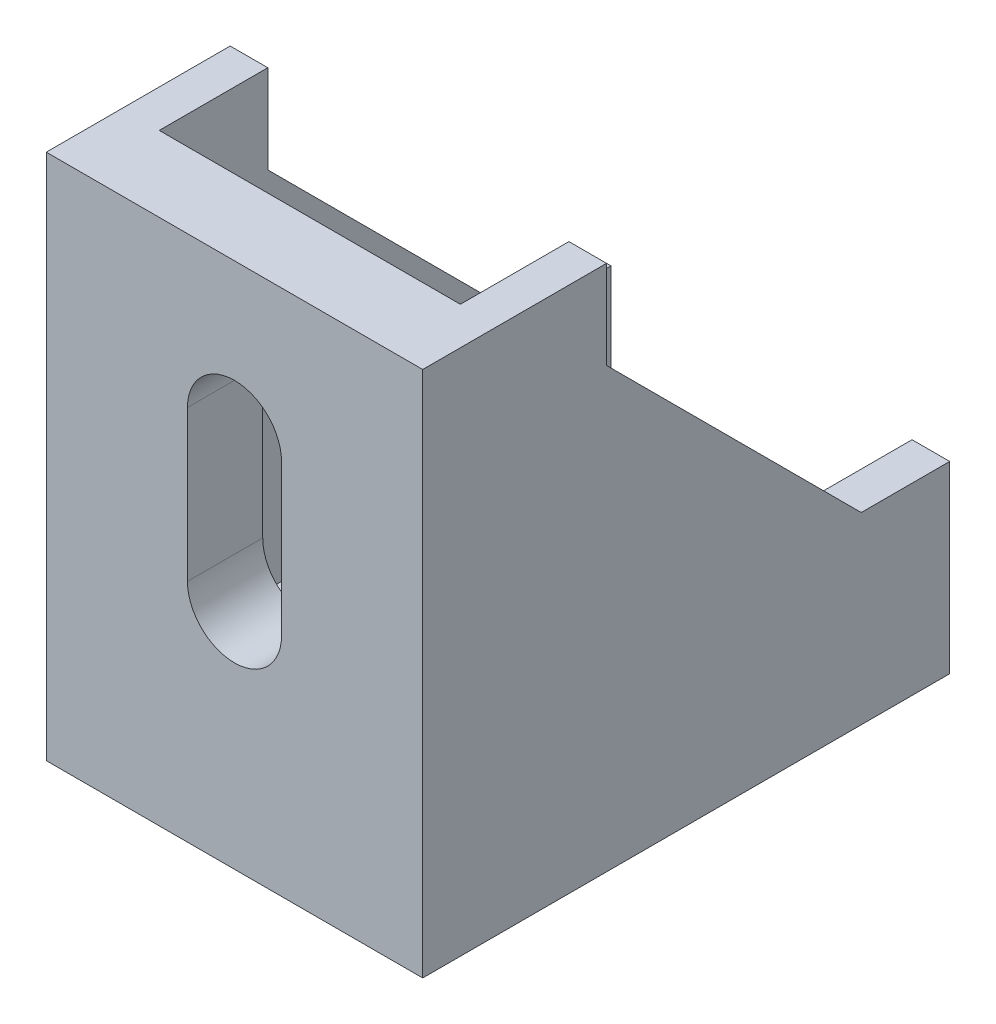
ISO-10303-21;
HEADER;
FILE_DESCRIPTION(('STEP AP214'),'2;1');
FILE_NAME('part.step','',(''),(''),'','','');
FILE_SCHEMA(('AUTOMOTIVE_DESIGN { 1 0 10303 214 1 1 1 1 }'));
ENDSEC;
DATA;
#1=APPLICATION_CONTEXT('core data for automotive mechanical design processes');
#2=APPLICATION_PROTOCOL_DEFINITION('international standard','automotive_design',2000,#1);
#3=PRODUCT_CONTEXT('',#1,'mechanical');
#4=PRODUCT('Part','Part','',(#3));
#5=PRODUCT_RELATED_PRODUCT_CATEGORY('part','',(#4));
#6=PRODUCT_DEFINITION_FORMATION('','',#4);
#7=PRODUCT_DEFINITION_CONTEXT('part definition',#1,'design');
#8=PRODUCT_DEFINITION('design','',#6,#7);
#9=PRODUCT_DEFINITION_SHAPE('','',#8);
#10=(LENGTH_UNIT() NAMED_UNIT(*) SI_UNIT(.MILLI.,.METRE.));
#11=(NAMED_UNIT(*) PLANE_ANGLE_UNIT() SI_UNIT($,.RADIAN.));
#12=(NAMED_UNIT(*) SI_UNIT($,.STERADIAN.) SOLID_ANGLE_UNIT());
#13=UNCERTAINTY_MEASURE_WITH_UNIT(LENGTH_MEASURE(1.E-05),#10,'distance_accuracy_value','');
#14=(GEOMETRIC_REPRESENTATION_CONTEXT(3) GLOBAL_UNCERTAINTY_ASSIGNED_CONTEXT((#13)) GLOBAL_UNIT_ASSIGNED_CONTEXT((#10,
#11,#12)) REPRESENTATION_CONTEXT('',''));
#15=CARTESIAN_POINT('',(0.,0.,0.));
#16=DIRECTION('',(0.,0.,1.));
#17=DIRECTION('',(1.,0.,0.));
#18=AXIS2_PLACEMENT_3D('',#15,#16,#17);
#19=CARTESIAN_POINT('',(20.,3.99999999999999,0.));
#20=DIRECTION('',(0.,1.,0.));
#21=DIRECTION('',(0.,0.,1.));
#22=AXIS2_PLACEMENT_3D('',#19,#20,#21);
#23=PLANE('',#22);
#24=CARTESIAN_POINT('',(10.,4.,-12.));
#25=DIRECTION('',(0.,1.,0.));
#26=DIRECTION('',(0.,0.,1.));
#27=AXIS2_PLACEMENT_3D('',#24,#25,#26);
#28=CIRCLE('',#27,2.5);
#29=CARTESIAN_POINT('',(7.5,4.,-12.));
#30=VERTEX_POINT('',#29);
#31=CARTESIAN_POINT('',(12.5,4.,-12.));
#32=VERTEX_POINT('',#31);
#33=EDGE_CURVE('E212',#30,#32,#28,.T.);
#34=ORIENTED_EDGE('',*,*,#33,.F.);
#35=DIRECTION('',(0.,0.,1.));
#36=VECTOR('',#35,1.);
#37=CARTESIAN_POINT('',(7.5,4.,-12.));
#38=LINE('',#37,#36);
#39=CARTESIAN_POINT('',(7.5,4.,-20.));
#40=VERTEX_POINT('',#39);
#41=EDGE_CURVE('E220',#40,#30,#38,.T.);
#42=ORIENTED_EDGE('',*,*,#41,.F.);
#43=CARTESIAN_POINT('',(10.,4.,-20.));
#44=DIRECTION('',(0.,1.,0.));
#45=DIRECTION('',(0.,0.,1.));
#46=AXIS2_PLACEMENT_3D('',#43,#44,#45);
#47=CIRCLE('',#46,2.5);
#48=CARTESIAN_POINT('',(12.5,4.,-20.));
#49=VERTEX_POINT('',#48);
#50=EDGE_CURVE('E234',#49,#40,#47,.T.);
#51=ORIENTED_EDGE('',*,*,#50,.F.);
#52=DIRECTION('',(0.,0.,-1.));
#53=VECTOR('',#52,1.);
#54=CARTESIAN_POINT('',(12.5,4.,-12.));
#55=LINE('',#54,#53);
#56=EDGE_CURVE('E231',#32,#49,#55,.T.);
#57=ORIENTED_EDGE('',*,*,#56,.F.);
#58=EDGE_LOOP('',(#34,#42,#51,#57));
#59=FACE_BOUND('',#58,.T.);
#60=DIRECTION('',(-1.,0.,0.));
#61=VECTOR('',#60,1.);
#62=CARTESIAN_POINT('',(20.,3.99999999999999,-4.));
#63=LINE('',#62,#61);
#64=CARTESIAN_POINT('',(18.,3.99999999999999,-4.));
#65=VERTEX_POINT('',#64);
#66=CARTESIAN_POINT('',(2.,3.99999999999999,-4.));
#67=VERTEX_POINT('',#66);
#68=EDGE_CURVE('E11',#65,#67,#63,.T.);
#69=ORIENTED_EDGE('',*,*,#68,.F.);
#70=DIRECTION('',(0.,0.,-1.));
#71=VECTOR('',#70,1.);
#72=CARTESIAN_POINT('',(18.,3.99999999999999,0.));
#73=LINE('',#72,#71);
#74=CARTESIAN_POINT('',(18.,4.,-28.));
#75=VERTEX_POINT('',#74);
#76=EDGE_CURVE('E250',#65,#75,#73,.T.);
#77=ORIENTED_EDGE('',*,*,#76,.T.);
#78=DIRECTION('',(-1.,0.,0.));
#79=VECTOR('',#78,1.);
#80=CARTESIAN_POINT('',(20.,4.,-28.));
#81=LINE('',#80,#79);
#82=CARTESIAN_POINT('',(2.,4.,-28.));
#83=VERTEX_POINT('',#82);
#84=EDGE_CURVE('E334',#75,#83,#81,.T.);
#85=ORIENTED_EDGE('',*,*,#84,.T.);
#86=DIRECTION('',(0.,0.,-1.));
#87=VECTOR('',#86,1.);
#88=CARTESIAN_POINT('',(2.,3.99999999999999,0.));
#89=LINE('',#88,#87);
#90=EDGE_CURVE('E285',#67,#83,#89,.T.);
#91=ORIENTED_EDGE('',*,*,#90,.F.);
#92=EDGE_LOOP('',(#69,#77,#85,#91));
#93=FACE_BOUND('',#92,.T.);
#94=ADVANCED_FACE('F32',(#59,#93),#23,.T.);
#95=CARTESIAN_POINT('',(20.,0.,-4.));
#96=DIRECTION('',(0.,0.,-1.));
#97=DIRECTION('',(0.,1.,0.));
#98=AXIS2_PLACEMENT_3D('',#95,#96,#97);
#99=PLANE('',#98);
#100=CARTESIAN_POINT('',(10.,12.,-4.));
#101=DIRECTION('',(0.,0.,-1.));
#102=DIRECTION('',(0.,1.,0.));
#103=AXIS2_PLACEMENT_3D('',#100,#101,#102);
#104=CIRCLE('',#103,2.5);
#105=CARTESIAN_POINT('',(12.5,12.,-4.));
#106=VERTEX_POINT('',#105);
#107=CARTESIAN_POINT('',(7.5,12.,-4.));
#108=VERTEX_POINT('',#107);
#109=EDGE_CURVE('E46',#106,#108,#104,.T.);
#110=ORIENTED_EDGE('',*,*,#109,.F.);
#111=DIRECTION('',(0.,1.,0.));
#112=VECTOR('',#111,1.);
#113=CARTESIAN_POINT('',(12.5,12.,-4.));
#114=LINE('',#113,#112);
#115=CARTESIAN_POINT('',(12.5,20.,-3.99999999999999));
#116=VERTEX_POINT('',#115);
#117=EDGE_CURVE('E197',#106,#116,#114,.T.);
#118=ORIENTED_EDGE('',*,*,#117,.T.);
#119=CARTESIAN_POINT('',(10.,20.,-3.99999999999999));
#120=DIRECTION('',(0.,0.,-1.));
#121=DIRECTION('',(0.,1.,0.));
#122=AXIS2_PLACEMENT_3D('',#119,#120,#121);
#123=CIRCLE('',#122,2.5);
#124=CARTESIAN_POINT('',(7.5,20.,-3.99999999999999));
#125=VERTEX_POINT('',#124);
#126=EDGE_CURVE('E200',#125,#116,#123,.T.);
#127=ORIENTED_EDGE('',*,*,#126,.F.);
#128=DIRECTION('',(0.,1.,0.));
#129=VECTOR('',#128,1.);
#130=CARTESIAN_POINT('',(7.5,12.,-4.));
#131=LINE('',#130,#129);
#132=EDGE_CURVE('E206',#108,#125,#131,.T.);
#133=ORIENTED_EDGE('',*,*,#132,.F.);
#134=EDGE_LOOP('',(#110,#118,#127,#133));
#135=FACE_BOUND('',#134,.T.);
#136=DIRECTION('',(-1.,0.,0.));
#137=VECTOR('',#136,1.);
#138=CARTESIAN_POINT('',(20.,28.,-3.99999999999999));
#139=LINE('',#138,#137);
#140=CARTESIAN_POINT('',(18.,28.,-3.99999999999999));
#141=VERTEX_POINT('',#140);
#142=CARTESIAN_POINT('',(2.,28.,-3.99999999999999));
#143=VERTEX_POINT('',#142);
#144=EDGE_CURVE('E39',#141,#143,#139,.T.);
#145=ORIENTED_EDGE('',*,*,#144,.F.);
#146=DIRECTION('',(0.,-1.,0.));
#147=VECTOR('',#146,1.);
#148=CARTESIAN_POINT('',(18.,0.,-4.));
#149=LINE('',#148,#147);
#150=EDGE_CURVE('E248',#141,#65,#149,.T.);
#151=ORIENTED_EDGE('',*,*,#150,.T.);
#152=ORIENTED_EDGE('',*,*,#68,.T.);
#153=DIRECTION('',(0.,-1.,0.));
#154=VECTOR('',#153,1.);
#155=CARTESIAN_POINT('',(2.,0.,-4.));
#156=LINE('',#155,#154);
#157=EDGE_CURVE('E282',#143,#67,#156,.T.);
#158=ORIENTED_EDGE('',*,*,#157,.F.);
#159=EDGE_LOOP('',(#145,#151,#152,#158));
#160=FACE_BOUND('',#159,.T.);
#161=ADVANCED_FACE('F364',(#135,#160),#99,.T.);
#162=CARTESIAN_POINT('',(20.,28.,0.));
#163=DIRECTION('',(0.,1.,0.));
#164=DIRECTION('',(0.,0.,1.));
#165=AXIS2_PLACEMENT_3D('',#162,#163,#164);
#166=PLANE('',#165);
#167=DIRECTION('',(0.,0.,-1.));
#168=VECTOR('',#167,1.);
#169=CARTESIAN_POINT('',(0.,28.,0.));
#170=LINE('',#169,#168);
#171=CARTESIAN_POINT('',(0.,28.,0.));
#172=VERTEX_POINT('',#171);
#173=CARTESIAN_POINT('',(0.,28.,-9.7688104986545));
#174=VERTEX_POINT('',#173);
#175=EDGE_CURVE('E321',#172,#174,#170,.T.);
#176=ORIENTED_EDGE('',*,*,#175,.F.);
#177=DIRECTION('',(-1.,0.,0.));
#178=VECTOR('',#177,1.);
#179=CARTESIAN_POINT('',(20.,28.,0.));
#180=LINE('',#179,#178);
#181=CARTESIAN_POINT('',(20.,28.,0.));
#182=VERTEX_POINT('',#181);
#183=EDGE_CURVE('E349',#182,#172,#180,.T.);
#184=ORIENTED_EDGE('',*,*,#183,.F.);
#185=DIRECTION('',(0.,0.,-1.));
#186=VECTOR('',#185,1.);
#187=CARTESIAN_POINT('',(20.,28.,0.));
#188=LINE('',#187,#186);
#189=CARTESIAN_POINT('',(20.,28.,-9.7688104986545));
#190=VERTEX_POINT('',#189);
#191=EDGE_CURVE('E322',#182,#190,#188,.T.);
#192=ORIENTED_EDGE('',*,*,#191,.T.);
#193=DIRECTION('',(1.,0.,0.));
#194=VECTOR('',#193,1.);
#195=CARTESIAN_POINT('',(18.,28.,-9.7688104986545));
#196=LINE('',#195,#194);
#197=CARTESIAN_POINT('',(18.,28.,-9.7688104986545));
#198=VERTEX_POINT('',#197);
#199=EDGE_CURVE('E270',#198,#190,#196,.T.);
#200=ORIENTED_EDGE('',*,*,#199,.F.);
#201=DIRECTION('',(0.,0.,-1.));
#202=VECTOR('',#201,1.);
#203=CARTESIAN_POINT('',(18.,28.,0.));
#204=LINE('',#203,#202);
#205=EDGE_CURVE('E262',#141,#198,#204,.T.);
#206=ORIENTED_EDGE('',*,*,#205,.F.);
#207=ORIENTED_EDGE('',*,*,#144,.T.);
#208=DIRECTION('',(0.,0.,-1.));
#209=VECTOR('',#208,1.);
#210=CARTESIAN_POINT('',(2.,28.,0.));
#211=LINE('',#210,#209);
#212=CARTESIAN_POINT('',(2.,28.,-9.7688104986545));
#213=VERTEX_POINT('',#212);
#214=EDGE_CURVE('E301',#143,#213,#211,.T.);
#215=ORIENTED_EDGE('',*,*,#214,.T.);
#216=DIRECTION('',(-1.,0.,0.));
#217=VECTOR('',#216,1.);
#218=CARTESIAN_POINT('',(2.,28.,-9.7688104986545));
#219=LINE('',#218,#217);
#220=EDGE_CURVE('E304',#213,#174,#219,.T.);
#221=ORIENTED_EDGE('',*,*,#220,.T.);
#222=EDGE_LOOP('',(#176,#184,#192,#200,#206,#207,#215,#221));
#223=FACE_BOUND('',#222,.T.);
#224=ADVANCED_FACE('F354',(#223),#166,.T.);
#225=CARTESIAN_POINT('',(20.,0.,0.));
#226=DIRECTION('',(0.,0.,1.));
#227=DIRECTION('',(1.,0.,0.));
#228=AXIS2_PLACEMENT_3D('',#225,#226,#227);
#229=PLANE('',#228);
#230=CARTESIAN_POINT('',(10.,12.,0.));
#231=DIRECTION('',(0.,0.,-1.));
#232=DIRECTION('',(0.,1.,0.));
#233=AXIS2_PLACEMENT_3D('',#230,#231,#232);
#234=CIRCLE('',#233,2.5);
#235=CARTESIAN_POINT('',(12.5,12.,0.));
#236=VERTEX_POINT('',#235);
#237=CARTESIAN_POINT('',(7.5,12.,0.));
#238=VERTEX_POINT('',#237);
#239=EDGE_CURVE('E182',#236,#238,#234,.T.);
#240=ORIENTED_EDGE('',*,*,#239,.T.);
#241=DIRECTION('',(0.,1.,0.));
#242=VECTOR('',#241,1.);
#243=CARTESIAN_POINT('',(7.5,12.,0.));
#244=LINE('',#243,#242);
#245=CARTESIAN_POINT('',(7.5,20.,0.));
#246=VERTEX_POINT('',#245);
#247=EDGE_CURVE('E191',#238,#246,#244,.T.);
#248=ORIENTED_EDGE('',*,*,#247,.T.);
#249=CARTESIAN_POINT('',(10.,20.,0.));
#250=DIRECTION('',(0.,0.,-1.));
#251=DIRECTION('',(0.,1.,0.));
#252=AXIS2_PLACEMENT_3D('',#249,#250,#251);
#253=CIRCLE('',#252,2.5);
#254=CARTESIAN_POINT('',(12.5,20.,0.));
#255=VERTEX_POINT('',#254);
#256=EDGE_CURVE('E54',#246,#255,#253,.T.);
#257=ORIENTED_EDGE('',*,*,#256,.T.);
#258=DIRECTION('',(0.,1.,0.));
#259=VECTOR('',#258,1.);
#260=CARTESIAN_POINT('',(12.5,12.,0.));
#261=LINE('',#260,#259);
#262=EDGE_CURVE('E188',#236,#255,#261,.T.);
#263=ORIENTED_EDGE('',*,*,#262,.F.);
#264=EDGE_LOOP('',(#240,#248,#257,#263));
#265=FACE_BOUND('',#264,.T.);
#266=DIRECTION('',(0.,1.,0.));
#267=VECTOR('',#266,1.);
#268=CARTESIAN_POINT('',(0.,0.,0.));
#269=LINE('',#268,#267);
#270=CARTESIAN_POINT('',(0.,0.,0.));
#271=VERTEX_POINT('',#270);
#272=EDGE_CURVE('E336',#271,#172,#269,.T.);
#273=ORIENTED_EDGE('',*,*,#272,.F.);
#274=DIRECTION('',(-1.,0.,0.));
#275=VECTOR('',#274,1.);
#276=CARTESIAN_POINT('',(20.,0.,0.));
#277=LINE('',#276,#275);
#278=CARTESIAN_POINT('',(20.,0.,0.));
#279=VERTEX_POINT('',#278);
#280=EDGE_CURVE('E347',#279,#271,#277,.T.);
#281=ORIENTED_EDGE('',*,*,#280,.F.);
#282=DIRECTION('',(0.,1.,0.));
#283=VECTOR('',#282,1.);
#284=CARTESIAN_POINT('',(20.,0.,0.));
#285=LINE('',#284,#283);
#286=EDGE_CURVE('E324',#279,#182,#285,.T.);
#287=ORIENTED_EDGE('',*,*,#286,.T.);
#288=ORIENTED_EDGE('',*,*,#183,.T.);
#289=EDGE_LOOP('',(#273,#281,#287,#288));
#290=FACE_BOUND('',#289,.T.);
#291=ADVANCED_FACE('F195',(#265,#290),#229,.T.);
#292=CARTESIAN_POINT('',(20.,0.,0.));
#293=DIRECTION('',(0.,-1.,0.));
#294=DIRECTION('',(0.,0.,-1.));
#295=AXIS2_PLACEMENT_3D('',#292,#293,#294);
#296=PLANE('',#295);
#297=CARTESIAN_POINT('',(10.,0.,-12.));
#298=DIRECTION('',(0.,1.,0.));
#299=DIRECTION('',(0.,0.,1.));
#300=AXIS2_PLACEMENT_3D('',#297,#298,#299);
#301=CIRCLE('',#300,2.5);
#302=CARTESIAN_POINT('',(7.5,0.,-12.));
#303=VERTEX_POINT('',#302);
#304=CARTESIAN_POINT('',(12.5,0.,-12.));
#305=VERTEX_POINT('',#304);
#306=EDGE_CURVE('E216',#303,#305,#301,.T.);
#307=ORIENTED_EDGE('',*,*,#306,.T.);
#308=DIRECTION('',(0.,0.,-1.));
#309=VECTOR('',#308,1.);
#310=CARTESIAN_POINT('',(12.5,0.,-12.));
#311=LINE('',#310,#309);
#312=CARTESIAN_POINT('',(12.5,0.,-20.));
#313=VERTEX_POINT('',#312);
#314=EDGE_CURVE('E219',#305,#313,#311,.T.);
#315=ORIENTED_EDGE('',*,*,#314,.T.);
#316=CARTESIAN_POINT('',(10.,0.,-20.));
#317=DIRECTION('',(0.,1.,0.));
#318=DIRECTION('',(0.,0.,1.));
#319=AXIS2_PLACEMENT_3D('',#316,#317,#318);
#320=CIRCLE('',#319,2.5);
#321=CARTESIAN_POINT('',(7.5,0.,-20.));
#322=VERTEX_POINT('',#321);
#323=EDGE_CURVE('E223',#313,#322,#320,.T.);
#324=ORIENTED_EDGE('',*,*,#323,.T.);
#325=DIRECTION('',(0.,0.,1.));
#326=VECTOR('',#325,1.);
#327=CARTESIAN_POINT('',(7.5,0.,-12.));
#328=LINE('',#327,#326);
#329=EDGE_CURVE('E226',#322,#303,#328,.T.);
#330=ORIENTED_EDGE('',*,*,#329,.T.);
#331=EDGE_LOOP('',(#307,#315,#324,#330));
#332=FACE_BOUND('',#331,.T.);
#333=DIRECTION('',(0.,0.,1.));
#334=VECTOR('',#333,1.);
#335=CARTESIAN_POINT('',(0.,0.,0.));
#336=LINE('',#335,#334);
#337=CARTESIAN_POINT('',(0.,0.,-28.));
#338=VERTEX_POINT('',#337);
#339=EDGE_CURVE('E339',#338,#271,#336,.T.);
#340=ORIENTED_EDGE('',*,*,#339,.F.);
#341=DIRECTION('',(-1.,0.,0.));
#342=VECTOR('',#341,1.);
#343=CARTESIAN_POINT('',(20.,0.,-28.));
#344=LINE('',#343,#342);
#345=CARTESIAN_POINT('',(20.,0.,-28.));
#346=VERTEX_POINT('',#345);
#347=EDGE_CURVE('E345',#346,#338,#344,.T.);
#348=ORIENTED_EDGE('',*,*,#347,.F.);
#349=DIRECTION('',(0.,0.,1.));
#350=VECTOR('',#349,1.);
#351=CARTESIAN_POINT('',(20.,0.,0.));
#352=LINE('',#351,#350);
#353=EDGE_CURVE('E328',#346,#279,#352,.T.);
#354=ORIENTED_EDGE('',*,*,#353,.T.);
#355=ORIENTED_EDGE('',*,*,#280,.T.);
#356=EDGE_LOOP('',(#340,#348,#354,#355));
#357=FACE_BOUND('',#356,.T.);
#358=ADVANCED_FACE('F398',(#332,#357),#296,.T.);
#359=CARTESIAN_POINT('',(20.,0.,-28.));
#360=DIRECTION('',(0.,0.,-1.));
#361=DIRECTION('',(0.,1.,0.));
#362=AXIS2_PLACEMENT_3D('',#359,#360,#361);
#363=PLANE('',#362);
#364=DIRECTION('',(0.,-1.,0.));
#365=VECTOR('',#364,1.);
#366=CARTESIAN_POINT('',(0.,0.,-28.));
#367=LINE('',#366,#365);
#368=CARTESIAN_POINT('',(0.,9.76881049865449,-28.));
#369=VERTEX_POINT('',#368);
#370=EDGE_CURVE('E325',#369,#338,#367,.T.);
#371=ORIENTED_EDGE('',*,*,#370,.F.);
#372=DIRECTION('',(-1.,0.,0.));
#373=VECTOR('',#372,1.);
#374=CARTESIAN_POINT('',(2.,9.76881049865449,-28.));
#375=LINE('',#374,#373);
#376=CARTESIAN_POINT('',(2.,9.76881049865449,-28.));
#377=VERTEX_POINT('',#376);
#378=EDGE_CURVE('E318',#377,#369,#375,.T.);
#379=ORIENTED_EDGE('',*,*,#378,.F.);
#380=DIRECTION('',(0.,-1.,0.));
#381=VECTOR('',#380,1.);
#382=CARTESIAN_POINT('',(2.,0.,-28.));
#383=LINE('',#382,#381);
#384=EDGE_CURVE('E289',#377,#83,#383,.T.);
#385=ORIENTED_EDGE('',*,*,#384,.T.);
#386=ORIENTED_EDGE('',*,*,#84,.F.);
#387=DIRECTION('',(0.,-1.,0.));
#388=VECTOR('',#387,1.);
#389=CARTESIAN_POINT('',(18.,0.,-28.));
#390=LINE('',#389,#388);
#391=CARTESIAN_POINT('',(18.,9.76881049865449,-28.));
#392=VERTEX_POINT('',#391);
#393=EDGE_CURVE('E253',#392,#75,#390,.T.);
#394=ORIENTED_EDGE('',*,*,#393,.F.);
#395=DIRECTION('',(1.,0.,0.));
#396=VECTOR('',#395,1.);
#397=CARTESIAN_POINT('',(18.,9.76881049865449,-28.));
#398=LINE('',#397,#396);
#399=CARTESIAN_POINT('',(20.,9.76881049865449,-28.));
#400=VERTEX_POINT('',#399);
#401=EDGE_CURVE('E264',#392,#400,#398,.T.);
#402=ORIENTED_EDGE('',*,*,#401,.T.);
#403=DIRECTION('',(0.,-1.,0.));
#404=VECTOR('',#403,1.);
#405=CARTESIAN_POINT('',(20.,0.,-28.));
#406=LINE('',#405,#404);
#407=EDGE_CURVE('E331',#400,#346,#406,.T.);
#408=ORIENTED_EDGE('',*,*,#407,.T.);
#409=ORIENTED_EDGE('',*,*,#347,.T.);
#410=EDGE_LOOP('',(#371,#379,#385,#386,#394,#402,#408,#409));
#411=FACE_BOUND('',#410,.T.);
#412=ADVANCED_FACE('F375',(#411),#363,.T.);
#413=CARTESIAN_POINT('',(20.,0.,0.));
#414=DIRECTION('',(1.,0.,0.));
#415=DIRECTION('',(0.,0.,-1.));
#416=AXIS2_PLACEMENT_3D('',#413,#414,#415);
#417=PLANE('',#416);
#418=ORIENTED_EDGE('',*,*,#407,.F.);
#419=DIRECTION('',(0.,0.,-1.));
#420=VECTOR('',#419,1.);
#421=CARTESIAN_POINT('',(20.,9.76881049865452,0.));
#422=LINE('',#421,#420);
#423=CARTESIAN_POINT('',(20.,9.7688104986545,-23.2999447337787));
#424=VERTEX_POINT('',#423);
#425=EDGE_CURVE('E241',#424,#400,#422,.T.);
#426=ORIENTED_EDGE('',*,*,#425,.F.);
#427=DIRECTION('',(0.,-0.707106781186548,-0.707106781186547));
#428=VECTOR('',#427,1.);
#429=CARTESIAN_POINT('',(20.,16.5343776162166,-16.5343776162166));
#430=LINE('',#429,#428);
#431=CARTESIAN_POINT('',(20.,23.2999447337787,-9.7688104986545));
#432=VERTEX_POINT('',#431);
#433=EDGE_CURVE('E267',#432,#424,#430,.T.);
#434=ORIENTED_EDGE('',*,*,#433,.F.);
#435=DIRECTION('',(0.,-1.,0.));
#436=VECTOR('',#435,1.);
#437=CARTESIAN_POINT('',(20.,0.,-9.7688104986545));
#438=LINE('',#437,#436);
#439=EDGE_CURVE('E251',#190,#432,#438,.T.);
#440=ORIENTED_EDGE('',*,*,#439,.F.);
#441=ORIENTED_EDGE('',*,*,#191,.F.);
#442=ORIENTED_EDGE('',*,*,#286,.F.);
#443=ORIENTED_EDGE('',*,*,#353,.F.);
#444=EDGE_LOOP('',(#418,#426,#434,#440,#441,#442,#443));
#445=FACE_BOUND('',#444,.T.);
#446=ADVANCED_FACE('F395',(#445),#417,.T.);
#447=CARTESIAN_POINT('',(0.,0.,0.));
#448=DIRECTION('',(1.,0.,0.));
#449=DIRECTION('',(0.,0.,-1.));
#450=AXIS2_PLACEMENT_3D('',#447,#448,#449);
#451=PLANE('',#450);
#452=ORIENTED_EDGE('',*,*,#175,.T.);
#453=DIRECTION('',(0.,-1.,0.));
#454=VECTOR('',#453,1.);
#455=CARTESIAN_POINT('',(0.,0.,-9.7688104986545));
#456=LINE('',#455,#454);
#457=CARTESIAN_POINT('',(0.,23.2999447337787,-9.7688104986545));
#458=VERTEX_POINT('',#457);
#459=EDGE_CURVE('E286',#174,#458,#456,.T.);
#460=ORIENTED_EDGE('',*,*,#459,.T.);
#461=DIRECTION('',(0.,-0.707106781186548,-0.707106781186547));
#462=VECTOR('',#461,1.);
#463=CARTESIAN_POINT('',(0.,16.5343776162166,-16.5343776162166));
#464=LINE('',#463,#462);
#465=CARTESIAN_POINT('',(0.,9.7688104986545,-23.2999447337787));
#466=VERTEX_POINT('',#465);
#467=EDGE_CURVE('E307',#458,#466,#464,.T.);
#468=ORIENTED_EDGE('',*,*,#467,.T.);
#469=DIRECTION('',(0.,0.,-1.));
#470=VECTOR('',#469,1.);
#471=CARTESIAN_POINT('',(0.,9.76881049865452,0.));
#472=LINE('',#471,#470);
#473=EDGE_CURVE('E273',#466,#369,#472,.T.);
#474=ORIENTED_EDGE('',*,*,#473,.T.);
#475=ORIENTED_EDGE('',*,*,#370,.T.);
#476=ORIENTED_EDGE('',*,*,#339,.T.);
#477=ORIENTED_EDGE('',*,*,#272,.T.);
#478=EDGE_LOOP('',(#452,#460,#468,#474,#475,#476,#477));
#479=FACE_BOUND('',#478,.T.);
#480=ADVANCED_FACE('F390',(#479),#451,.F.);
#481=CARTESIAN_POINT('',(2.,9.76881049865452,0.));
#482=DIRECTION('',(0.,1.,0.));
#483=DIRECTION('',(0.,0.,1.));
#484=AXIS2_PLACEMENT_3D('',#481,#482,#483);
#485=PLANE('',#484);
#486=ORIENTED_EDGE('',*,*,#473,.F.);
#487=DIRECTION('',(-1.,0.,0.));
#488=VECTOR('',#487,1.);
#489=CARTESIAN_POINT('',(2.,9.7688104986545,-23.2999447337787));
#490=LINE('',#489,#488);
#491=CARTESIAN_POINT('',(2.,9.7688104986545,-23.2999447337787));
#492=VERTEX_POINT('',#491);
#493=EDGE_CURVE('E316',#492,#466,#490,.T.);
#494=ORIENTED_EDGE('',*,*,#493,.F.);
#495=DIRECTION('',(0.,0.,-1.));
#496=VECTOR('',#495,1.);
#497=CARTESIAN_POINT('',(2.,9.76881049865452,0.));
#498=LINE('',#497,#496);
#499=EDGE_CURVE('E292',#492,#377,#498,.T.);
#500=ORIENTED_EDGE('',*,*,#499,.T.);
#501=ORIENTED_EDGE('',*,*,#378,.T.);
#502=EDGE_LOOP('',(#486,#494,#500,#501));
#503=FACE_BOUND('',#502,.T.);
#504=ADVANCED_FACE('F380',(#503),#485,.T.);
#505=CARTESIAN_POINT('',(2.,16.5343776162166,-16.5343776162166));
#506=DIRECTION('',(0.,0.707106781186547,-0.707106781186548));
#507=DIRECTION('',(0.,0.707106781186548,0.707106781186547));
#508=AXIS2_PLACEMENT_3D('',#505,#506,#507);
#509=PLANE('',#508);
#510=ORIENTED_EDGE('',*,*,#467,.F.);
#511=DIRECTION('',(-1.,0.,0.));
#512=VECTOR('',#511,1.);
#513=CARTESIAN_POINT('',(2.,23.2999447337787,-9.7688104986545));
#514=LINE('',#513,#512);
#515=CARTESIAN_POINT('',(2.,23.2999447337787,-9.7688104986545));
#516=VERTEX_POINT('',#515);
#517=EDGE_CURVE('E314',#516,#458,#514,.T.);
#518=ORIENTED_EDGE('',*,*,#517,.F.);
#519=DIRECTION('',(0.,-0.707106781186548,-0.707106781186547));
#520=VECTOR('',#519,1.);
#521=CARTESIAN_POINT('',(2.,16.5343776162166,-16.5343776162166));
#522=LINE('',#521,#520);
#523=EDGE_CURVE('E295',#516,#492,#522,.T.);
#524=ORIENTED_EDGE('',*,*,#523,.T.);
#525=ORIENTED_EDGE('',*,*,#493,.T.);
#526=EDGE_LOOP('',(#510,#518,#524,#525));
#527=FACE_BOUND('',#526,.T.);
#528=ADVANCED_FACE('F383',(#527),#509,.T.);
#529=CARTESIAN_POINT('',(2.,0.,-9.7688104986545));
#530=DIRECTION('',(0.,0.,-1.));
#531=DIRECTION('',(-1.,0.,0.));
#532=AXIS2_PLACEMENT_3D('',#529,#530,#531);
#533=PLANE('',#532);
#534=ORIENTED_EDGE('',*,*,#459,.F.);
#535=ORIENTED_EDGE('',*,*,#220,.F.);
#536=DIRECTION('',(0.,-1.,0.));
#537=VECTOR('',#536,1.);
#538=CARTESIAN_POINT('',(2.,0.,-9.7688104986545));
#539=LINE('',#538,#537);
#540=EDGE_CURVE('E298',#213,#516,#539,.T.);
#541=ORIENTED_EDGE('',*,*,#540,.T.);
#542=ORIENTED_EDGE('',*,*,#517,.T.);
#543=EDGE_LOOP('',(#534,#535,#541,#542));
#544=FACE_BOUND('',#543,.T.);
#545=ADVANCED_FACE('F386',(#544),#533,.T.);
#546=CARTESIAN_POINT('',(2.,0.,0.));
#547=DIRECTION('',(1.,0.,0.));
#548=DIRECTION('',(0.,0.,-1.));
#549=AXIS2_PLACEMENT_3D('',#546,#547,#548);
#550=PLANE('',#549);
#551=ORIENTED_EDGE('',*,*,#157,.T.);
#552=ORIENTED_EDGE('',*,*,#90,.T.);
#553=ORIENTED_EDGE('',*,*,#384,.F.);
#554=ORIENTED_EDGE('',*,*,#499,.F.);
#555=ORIENTED_EDGE('',*,*,#523,.F.);
#556=ORIENTED_EDGE('',*,*,#540,.F.);
#557=ORIENTED_EDGE('',*,*,#214,.F.);
#558=EDGE_LOOP('',(#551,#552,#553,#554,#555,#556,#557));
#559=FACE_BOUND('',#558,.T.);
#560=ADVANCED_FACE('F361',(#559),#550,.T.);
#561=CARTESIAN_POINT('',(18.,0.,-9.7688104986545));
#562=DIRECTION('',(0.,0.,1.));
#563=DIRECTION('',(1.,0.,0.));
#564=AXIS2_PLACEMENT_3D('',#561,#562,#563);
#565=PLANE('',#564);
#566=ORIENTED_EDGE('',*,*,#439,.T.);
#567=DIRECTION('',(1.,0.,0.));
#568=VECTOR('',#567,1.);
#569=CARTESIAN_POINT('',(18.,23.2999447337787,-9.7688104986545));
#570=LINE('',#569,#568);
#571=CARTESIAN_POINT('',(18.,23.2999447337787,-9.7688104986545));
#572=VERTEX_POINT('',#571);
#573=EDGE_CURVE('E274',#572,#432,#570,.T.);
#574=ORIENTED_EDGE('',*,*,#573,.F.);
#575=DIRECTION('',(0.,-1.,0.));
#576=VECTOR('',#575,1.);
#577=CARTESIAN_POINT('',(18.,0.,-9.7688104986545));
#578=LINE('',#577,#576);
#579=EDGE_CURVE('E260',#198,#572,#578,.T.);
#580=ORIENTED_EDGE('',*,*,#579,.F.);
#581=ORIENTED_EDGE('',*,*,#199,.T.);
#582=EDGE_LOOP('',(#566,#574,#580,#581));
#583=FACE_BOUND('',#582,.T.);
#584=ADVANCED_FACE('F409',(#583),#565,.F.);
#585=CARTESIAN_POINT('',(18.,16.5343776162166,-16.5343776162166));
#586=DIRECTION('',(0.,-0.707106781186547,0.707106781186548));
#587=DIRECTION('',(0.,-0.707106781186548,-0.707106781186547));
#588=AXIS2_PLACEMENT_3D('',#585,#586,#587);
#589=PLANE('',#588);
#590=ORIENTED_EDGE('',*,*,#433,.T.);
#591=DIRECTION('',(1.,0.,0.));
#592=VECTOR('',#591,1.);
#593=CARTESIAN_POINT('',(18.,9.7688104986545,-23.2999447337787));
#594=LINE('',#593,#592);
#595=CARTESIAN_POINT('',(18.,9.7688104986545,-23.2999447337787));
#596=VERTEX_POINT('',#595);
#597=EDGE_CURVE('E277',#596,#424,#594,.T.);
#598=ORIENTED_EDGE('',*,*,#597,.F.);
#599=DIRECTION('',(0.,-0.707106781186548,-0.707106781186547));
#600=VECTOR('',#599,1.);
#601=CARTESIAN_POINT('',(18.,16.5343776162166,-16.5343776162166));
#602=LINE('',#601,#600);
#603=EDGE_CURVE('E258',#572,#596,#602,.T.);
#604=ORIENTED_EDGE('',*,*,#603,.F.);
#605=ORIENTED_EDGE('',*,*,#573,.T.);
#606=EDGE_LOOP('',(#590,#598,#604,#605));
#607=FACE_BOUND('',#606,.T.);
#608=ADVANCED_FACE('F406',(#607),#589,.F.);
#609=CARTESIAN_POINT('',(18.,9.76881049865452,0.));
#610=DIRECTION('',(0.,-1.,0.));
#611=DIRECTION('',(0.,0.,-1.));
#612=AXIS2_PLACEMENT_3D('',#609,#610,#611);
#613=PLANE('',#612);
#614=ORIENTED_EDGE('',*,*,#425,.T.);
#615=ORIENTED_EDGE('',*,*,#401,.F.);
#616=DIRECTION('',(0.,0.,-1.));
#617=VECTOR('',#616,1.);
#618=CARTESIAN_POINT('',(18.,9.76881049865452,0.));
#619=LINE('',#618,#617);
#620=EDGE_CURVE('E256',#596,#392,#619,.T.);
#621=ORIENTED_EDGE('',*,*,#620,.F.);
#622=ORIENTED_EDGE('',*,*,#597,.T.);
#623=EDGE_LOOP('',(#614,#615,#621,#622));
#624=FACE_BOUND('',#623,.T.);
#625=ADVANCED_FACE('F402',(#624),#613,.F.);
#626=CARTESIAN_POINT('',(18.,0.,0.));
#627=DIRECTION('',(1.,0.,0.));
#628=DIRECTION('',(0.,0.,-1.));
#629=AXIS2_PLACEMENT_3D('',#626,#627,#628);
#630=PLANE('',#629);
#631=ORIENTED_EDGE('',*,*,#150,.F.);
#632=ORIENTED_EDGE('',*,*,#205,.T.);
#633=ORIENTED_EDGE('',*,*,#579,.T.);
#634=ORIENTED_EDGE('',*,*,#603,.T.);
#635=ORIENTED_EDGE('',*,*,#620,.T.);
#636=ORIENTED_EDGE('',*,*,#393,.T.);
#637=ORIENTED_EDGE('',*,*,#76,.F.);
#638=EDGE_LOOP('',(#631,#632,#633,#634,#635,#636,#637));
#639=FACE_BOUND('',#638,.T.);
#640=ADVANCED_FACE('F370',(#639),#630,.F.);
#641=CARTESIAN_POINT('',(10.,0.,-12.));
#642=DIRECTION('',(0.,1.,0.));
#643=DIRECTION('',(0.,0.,1.));
#644=AXIS2_PLACEMENT_3D('',#641,#642,#643);
#645=CYLINDRICAL_SURFACE('',#644,2.5);
#646=ORIENTED_EDGE('',*,*,#33,.T.);
#647=DIRECTION('',(0.,1.,0.));
#648=VECTOR('',#647,1.);
#649=CARTESIAN_POINT('',(12.5,0.,-12.));
#650=LINE('',#649,#648);
#651=EDGE_CURVE('E229',#305,#32,#650,.T.);
#652=ORIENTED_EDGE('',*,*,#651,.F.);
#653=ORIENTED_EDGE('',*,*,#306,.F.);
#654=DIRECTION('',(0.,1.,0.));
#655=VECTOR('',#654,1.);
#656=CARTESIAN_POINT('',(7.5,0.,-12.));
#657=LINE('',#656,#655);
#658=EDGE_CURVE('E239',#303,#30,#657,.T.);
#659=ORIENTED_EDGE('',*,*,#658,.T.);
#660=EDGE_LOOP('',(#646,#652,#653,#659));
#661=FACE_BOUND('',#660,.T.);
#662=ADVANCED_FACE('F431',(#661),#645,.F.);
#663=CARTESIAN_POINT('',(7.5,0.,-12.));
#664=DIRECTION('',(-1.,0.,0.));
#665=DIRECTION('',(0.,0.,1.));
#666=AXIS2_PLACEMENT_3D('',#663,#664,#665);
#667=PLANE('',#666);
#668=ORIENTED_EDGE('',*,*,#41,.T.);
#669=ORIENTED_EDGE('',*,*,#658,.F.);
#670=ORIENTED_EDGE('',*,*,#329,.F.);
#671=DIRECTION('',(0.,1.,0.));
#672=VECTOR('',#671,1.);
#673=CARTESIAN_POINT('',(7.5,0.,-20.));
#674=LINE('',#673,#672);
#675=EDGE_CURVE('E242',#322,#40,#674,.T.);
#676=ORIENTED_EDGE('',*,*,#675,.T.);
#677=EDGE_LOOP('',(#668,#669,#670,#676));
#678=FACE_BOUND('',#677,.T.);
#679=ADVANCED_FACE('F440',(#678),#667,.F.);
#680=CARTESIAN_POINT('',(10.,0.,-20.));
#681=DIRECTION('',(0.,1.,0.));
#682=DIRECTION('',(0.,0.,1.));
#683=AXIS2_PLACEMENT_3D('',#680,#681,#682);
#684=CYLINDRICAL_SURFACE('',#683,2.5);
#685=ORIENTED_EDGE('',*,*,#50,.T.);
#686=ORIENTED_EDGE('',*,*,#675,.F.);
#687=ORIENTED_EDGE('',*,*,#323,.F.);
#688=DIRECTION('',(0.,1.,0.));
#689=VECTOR('',#688,1.);
#690=CARTESIAN_POINT('',(12.5,0.,-20.));
#691=LINE('',#690,#689);
#692=EDGE_CURVE('E244',#313,#49,#691,.T.);
#693=ORIENTED_EDGE('',*,*,#692,.T.);
#694=EDGE_LOOP('',(#685,#686,#687,#693));
#695=FACE_BOUND('',#694,.T.);
#696=ADVANCED_FACE('F442',(#695),#684,.F.);
#697=CARTESIAN_POINT('',(12.5,0.,-12.));
#698=DIRECTION('',(1.,0.,0.));
#699=DIRECTION('',(0.,0.,-1.));
#700=AXIS2_PLACEMENT_3D('',#697,#698,#699);
#701=PLANE('',#700);
#702=ORIENTED_EDGE('',*,*,#56,.T.);
#703=ORIENTED_EDGE('',*,*,#692,.F.);
#704=ORIENTED_EDGE('',*,*,#314,.F.);
#705=ORIENTED_EDGE('',*,*,#651,.T.);
#706=EDGE_LOOP('',(#702,#703,#704,#705));
#707=FACE_BOUND('',#706,.T.);
#708=ADVANCED_FACE('F435',(#707),#701,.F.);
#709=CARTESIAN_POINT('',(10.,12.,0.));
#710=DIRECTION('',(0.,0.,-1.));
#711=DIRECTION('',(0.,1.,0.));
#712=AXIS2_PLACEMENT_3D('',#709,#710,#711);
#713=CYLINDRICAL_SURFACE('',#712,2.5);
#714=ORIENTED_EDGE('',*,*,#109,.T.);
#715=DIRECTION('',(0.,0.,-1.));
#716=VECTOR('',#715,1.);
#717=CARTESIAN_POINT('',(7.5,12.,0.));
#718=LINE('',#717,#716);
#719=EDGE_CURVE('E178',#238,#108,#718,.T.);
#720=ORIENTED_EDGE('',*,*,#719,.F.);
#721=ORIENTED_EDGE('',*,*,#239,.F.);
#722=DIRECTION('',(0.,0.,-1.));
#723=VECTOR('',#722,1.);
#724=CARTESIAN_POINT('',(12.5,12.,0.));
#725=LINE('',#724,#723);
#726=EDGE_CURVE('E210',#236,#106,#725,.T.);
#727=ORIENTED_EDGE('',*,*,#726,.T.);
#728=EDGE_LOOP('',(#714,#720,#721,#727));
#729=FACE_BOUND('',#728,.T.);
#730=ADVANCED_FACE('F180',(#729),#713,.F.);
#731=CARTESIAN_POINT('',(12.5,12.,0.));
#732=DIRECTION('',(-1.,0.,0.));
#733=DIRECTION('',(0.,0.,1.));
#734=AXIS2_PLACEMENT_3D('',#731,#732,#733);
#735=PLANE('',#734);
#736=ORIENTED_EDGE('',*,*,#117,.F.);
#737=ORIENTED_EDGE('',*,*,#726,.F.);
#738=ORIENTED_EDGE('',*,*,#262,.T.);
#739=DIRECTION('',(0.,0.,-1.));
#740=VECTOR('',#739,1.);
#741=CARTESIAN_POINT('',(12.5,20.,0.));
#742=LINE('',#741,#740);
#743=EDGE_CURVE('E213',#255,#116,#742,.T.);
#744=ORIENTED_EDGE('',*,*,#743,.T.);
#745=EDGE_LOOP('',(#736,#737,#738,#744));
#746=FACE_BOUND('',#745,.T.);
#747=ADVANCED_FACE('F593',(#746),#735,.T.);
#748=CARTESIAN_POINT('',(10.,20.,0.));
#749=DIRECTION('',(0.,0.,-1.));
#750=DIRECTION('',(0.,1.,0.));
#751=AXIS2_PLACEMENT_3D('',#748,#749,#750);
#752=CYLINDRICAL_SURFACE('',#751,2.5);
#753=ORIENTED_EDGE('',*,*,#126,.T.);
#754=ORIENTED_EDGE('',*,*,#743,.F.);
#755=ORIENTED_EDGE('',*,*,#256,.F.);
#756=DIRECTION('',(0.,0.,-1.));
#757=VECTOR('',#756,1.);
#758=CARTESIAN_POINT('',(7.5,20.,0.));
#759=LINE('',#758,#757);
#760=EDGE_CURVE('E187',#246,#125,#759,.T.);
#761=ORIENTED_EDGE('',*,*,#760,.T.);
#762=EDGE_LOOP('',(#753,#754,#755,#761));
#763=FACE_BOUND('',#762,.T.);
#764=ADVANCED_FACE('F600',(#763),#752,.F.);
#765=CARTESIAN_POINT('',(7.5,12.,0.));
#766=DIRECTION('',(-1.,0.,0.));
#767=DIRECTION('',(0.,0.,1.));
#768=AXIS2_PLACEMENT_3D('',#765,#766,#767);
#769=PLANE('',#768);
#770=ORIENTED_EDGE('',*,*,#132,.T.);
#771=ORIENTED_EDGE('',*,*,#760,.F.);
#772=ORIENTED_EDGE('',*,*,#247,.F.);
#773=ORIENTED_EDGE('',*,*,#719,.T.);
#774=EDGE_LOOP('',(#770,#771,#772,#773));
#775=FACE_BOUND('',#774,.T.);
#776=ADVANCED_FACE('F192',(#775),#769,.F.);
#777=CLOSED_SHELL('',(#94,#161,#224,#291,#358,#412,#446,#480,#504,#528,#545,#560,#584,#608,#625,
#640,#662,#679,#696,#708,#730,#747,#764,#776));
#778=MANIFOLD_SOLID_BREP('B2',#777);
#779=ADVANCED_BREP_SHAPE_REPRESENTATION('',(#18,#778),#14);
#780=SHAPE_DEFINITION_REPRESENTATION(#9,#779);
ENDSEC;
END-ISO-10303-21;
